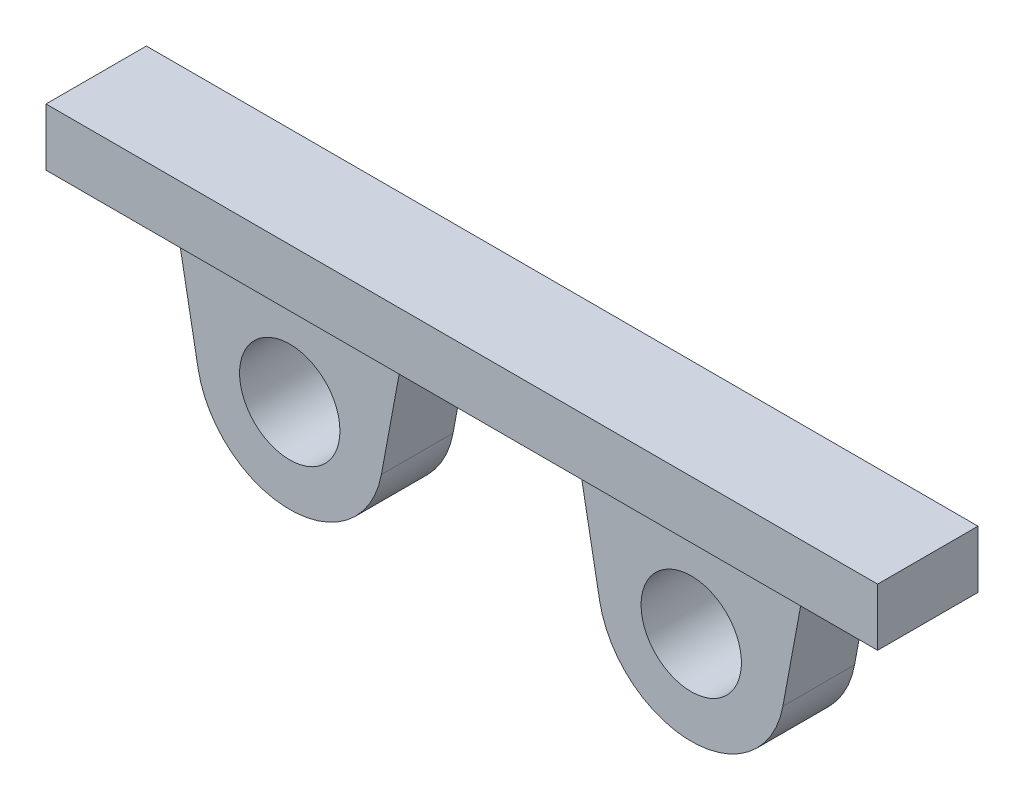
ISO-10303-21;
HEADER;
FILE_DESCRIPTION(('STEP AP214'),'2;1');
FILE_NAME('part.step','',(''),(''),'','','');
FILE_SCHEMA(('AUTOMOTIVE_DESIGN { 1 0 10303 214 1 1 1 1 }'));
ENDSEC;
DATA;
#1=APPLICATION_CONTEXT('core data for automotive mechanical design processes');
#2=APPLICATION_PROTOCOL_DEFINITION('international standard','automotive_design',2000,#1);
#3=PRODUCT_CONTEXT('',#1,'mechanical');
#4=PRODUCT('Part','Part','',(#3));
#5=PRODUCT_RELATED_PRODUCT_CATEGORY('part','',(#4));
#6=PRODUCT_DEFINITION_FORMATION('','',#4);
#7=PRODUCT_DEFINITION_CONTEXT('part definition',#1,'design');
#8=PRODUCT_DEFINITION('design','',#6,#7);
#9=PRODUCT_DEFINITION_SHAPE('','',#8);
#10=(LENGTH_UNIT() NAMED_UNIT(*) SI_UNIT(.MILLI.,.METRE.));
#11=(NAMED_UNIT(*) PLANE_ANGLE_UNIT() SI_UNIT($,.RADIAN.));
#12=(NAMED_UNIT(*) SI_UNIT($,.STERADIAN.) SOLID_ANGLE_UNIT());
#13=UNCERTAINTY_MEASURE_WITH_UNIT(LENGTH_MEASURE(1.E-05),#10,'distance_accuracy_value','');
#14=(GEOMETRIC_REPRESENTATION_CONTEXT(3) GLOBAL_UNCERTAINTY_ASSIGNED_CONTEXT((#13)) GLOBAL_UNIT_ASSIGNED_CONTEXT((#10,
#11,#12)) REPRESENTATION_CONTEXT('',''));
#15=CARTESIAN_POINT('',(0.,0.,0.));
#16=DIRECTION('',(0.,0.,1.));
#17=DIRECTION('',(1.,0.,0.));
#18=AXIS2_PLACEMENT_3D('',#15,#16,#17);
#19=CARTESIAN_POINT('',(-14.,0.,5.));
#20=DIRECTION('',(0.,0.,1.));
#21=DIRECTION('',(1.,0.,0.));
#22=AXIS2_PLACEMENT_3D('',#19,#20,#21);
#23=PLANE('',#22);
#24=DIRECTION('',(1.,0.,0.));
#25=VECTOR('',#24,1.);
#26=CARTESIAN_POINT('',(29.,7.5,5.));
#27=LINE('',#26,#25);
#28=CARTESIAN_POINT('',(-22.,7.5,5.));
#29=VERTEX_POINT('',#28);
#30=CARTESIAN_POINT('',(-6.,7.5,5.));
#31=VERTEX_POINT('',#30);
#32=EDGE_CURVE('E11',#29,#31,#27,.T.);
#33=ORIENTED_EDGE('',*,*,#32,.F.);
#34=DIRECTION('',(0.182154569069628,-0.983269908502776,0.));
#35=VECTOR('',#34,1.);
#36=CARTESIAN_POINT('',(-22.,7.5,5.));
#37=LINE('',#36,#35);
#38=CARTESIAN_POINT('',(-20.391254405268,-1.18400469895258,5.));
#39=VERTEX_POINT('',#38);
#40=EDGE_CURVE('E54',#29,#39,#37,.T.);
#41=ORIENTED_EDGE('',*,*,#40,.T.);
#42=CARTESIAN_POINT('',(-14.,0.,5.));
#43=DIRECTION('',(0.,0.,1.));
#44=DIRECTION('',(1.,0.,0.));
#45=AXIS2_PLACEMENT_3D('',#42,#43,#44);
#46=CIRCLE('',#45,6.5);
#47=CARTESIAN_POINT('',(-7.60874559473196,-1.18400469895258,5.));
#48=VERTEX_POINT('',#47);
#49=EDGE_CURVE('E178',#39,#48,#46,.T.);
#50=ORIENTED_EDGE('',*,*,#49,.T.);
#51=DIRECTION('',(0.182154569069628,0.983269908502776,0.));
#52=VECTOR('',#51,1.);
#53=CARTESIAN_POINT('',(-7.60874559473196,-1.18400469895258,5.));
#54=LINE('',#53,#52);
#55=EDGE_CURVE('E111',#48,#31,#54,.T.);
#56=ORIENTED_EDGE('',*,*,#55,.T.);
#57=EDGE_LOOP('',(#33,#41,#50,#56));
#58=FACE_BOUND('',#57,.T.);
#59=CARTESIAN_POINT('',(-14.,0.,5.));
#60=DIRECTION('',(0.,0.,1.));
#61=DIRECTION('',(1.,0.,0.));
#62=AXIS2_PLACEMENT_3D('',#59,#60,#61);
#63=CIRCLE('',#62,3.5);
#64=CARTESIAN_POINT('',(-10.5,0.,5.));
#65=VERTEX_POINT('',#64);
#66=EDGE_CURVE('E172',#65,#65,#63,.T.);
#67=ORIENTED_EDGE('',*,*,#66,.F.);
#68=EDGE_LOOP('',(#67));
#69=FACE_BOUND('',#68,.T.);
#70=ADVANCED_FACE('F35',(#58,#69),#23,.T.);
#71=CARTESIAN_POINT('',(6.,7.5,5.));
#72=VERTEX_POINT('',#71);
#73=CARTESIAN_POINT('',(22.,7.5,5.));
#74=VERTEX_POINT('',#73);
#75=EDGE_CURVE('E45',#72,#74,#27,.T.);
#76=ORIENTED_EDGE('',*,*,#75,.F.);
#77=DIRECTION('',(0.182154569069628,-0.983269908502776,0.));
#78=VECTOR('',#77,1.);
#79=CARTESIAN_POINT('',(7.60874559473196,-1.18400469895258,5.));
#80=LINE('',#79,#78);
#81=CARTESIAN_POINT('',(7.60874559473196,-1.18400469895258,5.));
#82=VERTEX_POINT('',#81);
#83=EDGE_CURVE('E181',#72,#82,#80,.T.);
#84=ORIENTED_EDGE('',*,*,#83,.T.);
#85=CARTESIAN_POINT('',(14.,0.,5.));
#86=DIRECTION('',(0.,0.,1.));
#87=DIRECTION('',(-1.,0.,0.));
#88=AXIS2_PLACEMENT_3D('',#85,#86,#87);
#89=CIRCLE('',#88,6.5);
#90=CARTESIAN_POINT('',(20.391254405268,-1.18400469895258,5.));
#91=VERTEX_POINT('',#90);
#92=EDGE_CURVE('E134',#82,#91,#89,.T.);
#93=ORIENTED_EDGE('',*,*,#92,.T.);
#94=DIRECTION('',(0.182154569069628,0.983269908502776,0.));
#95=VECTOR('',#94,1.);
#96=CARTESIAN_POINT('',(22.,7.5,5.));
#97=LINE('',#96,#95);
#98=EDGE_CURVE('E127',#91,#74,#97,.T.);
#99=ORIENTED_EDGE('',*,*,#98,.T.);
#100=EDGE_LOOP('',(#76,#84,#93,#99));
#101=FACE_BOUND('',#100,.T.);
#102=CARTESIAN_POINT('',(14.,0.,5.));
#103=DIRECTION('',(0.,0.,1.));
#104=DIRECTION('',(-1.,0.,0.));
#105=AXIS2_PLACEMENT_3D('',#102,#103,#104);
#106=CIRCLE('',#105,3.5);
#107=CARTESIAN_POINT('',(10.5,0.,5.));
#108=VERTEX_POINT('',#107);
#109=EDGE_CURVE('E166',#108,#108,#106,.T.);
#110=ORIENTED_EDGE('',*,*,#109,.F.);
#111=EDGE_LOOP('',(#110));
#112=FACE_BOUND('',#111,.T.);
#113=ADVANCED_FACE('F129',(#101,#112),#23,.T.);
#114=CARTESIAN_POINT('',(-14.,0.,0.));
#115=DIRECTION('',(0.,0.,1.));
#116=DIRECTION('',(1.,0.,0.));
#117=AXIS2_PLACEMENT_3D('',#114,#115,#116);
#118=PLANE('',#117);
#119=CARTESIAN_POINT('',(-14.,0.,0.));
#120=DIRECTION('',(0.,0.,1.));
#121=DIRECTION('',(1.,0.,0.));
#122=AXIS2_PLACEMENT_3D('',#119,#120,#121);
#123=CIRCLE('',#122,6.5);
#124=CARTESIAN_POINT('',(-20.391254405268,-1.18400469895258,0.));
#125=VERTEX_POINT('',#124);
#126=CARTESIAN_POINT('',(-7.60874559473196,-1.18400469895258,0.));
#127=VERTEX_POINT('',#126);
#128=EDGE_CURVE('E175',#125,#127,#123,.T.);
#129=ORIENTED_EDGE('',*,*,#128,.F.);
#130=DIRECTION('',(0.182154569069628,-0.983269908502776,0.));
#131=VECTOR('',#130,1.);
#132=CARTESIAN_POINT('',(-22.,7.5,0.));
#133=LINE('',#132,#131);
#134=CARTESIAN_POINT('',(-22.,7.5,0.));
#135=VERTEX_POINT('',#134);
#136=EDGE_CURVE('E102',#135,#125,#133,.T.);
#137=ORIENTED_EDGE('',*,*,#136,.F.);
#138=DIRECTION('',(1.,0.,0.));
#139=VECTOR('',#138,1.);
#140=CARTESIAN_POINT('',(-29.,7.5,0.));
#141=LINE('',#140,#139);
#142=CARTESIAN_POINT('',(-29.,7.5,0.));
#143=VERTEX_POINT('',#142);
#144=EDGE_CURVE('E96',#143,#135,#141,.T.);
#145=ORIENTED_EDGE('',*,*,#144,.F.);
#146=DIRECTION('',(0.,-1.,0.));
#147=VECTOR('',#146,1.);
#148=CARTESIAN_POINT('',(-29.,11.5,0.));
#149=LINE('',#148,#147);
#150=CARTESIAN_POINT('',(-29.,11.5,0.));
#151=VERTEX_POINT('',#150);
#152=EDGE_CURVE('E203',#151,#143,#149,.T.);
#153=ORIENTED_EDGE('',*,*,#152,.F.);
#154=DIRECTION('',(-1.,0.,0.));
#155=VECTOR('',#154,1.);
#156=CARTESIAN_POINT('',(29.,11.5,0.));
#157=LINE('',#156,#155);
#158=CARTESIAN_POINT('',(29.,11.5,0.));
#159=VERTEX_POINT('',#158);
#160=EDGE_CURVE('E201',#159,#151,#157,.T.);
#161=ORIENTED_EDGE('',*,*,#160,.F.);
#162=DIRECTION('',(0.,1.,0.));
#163=VECTOR('',#162,1.);
#164=CARTESIAN_POINT('',(29.,11.5,0.));
#165=LINE('',#164,#163);
#166=CARTESIAN_POINT('',(29.,7.5,0.));
#167=VERTEX_POINT('',#166);
#168=EDGE_CURVE('E199',#167,#159,#165,.T.);
#169=ORIENTED_EDGE('',*,*,#168,.F.);
#170=DIRECTION('',(1.,0.,0.));
#171=VECTOR('',#170,1.);
#172=CARTESIAN_POINT('',(29.,7.5,0.));
#173=LINE('',#172,#171);
#174=CARTESIAN_POINT('',(22.,7.5,0.));
#175=VERTEX_POINT('',#174);
#176=EDGE_CURVE('E197',#175,#167,#173,.T.);
#177=ORIENTED_EDGE('',*,*,#176,.F.);
#178=DIRECTION('',(0.182154569069628,0.983269908502776,0.));
#179=VECTOR('',#178,1.);
#180=CARTESIAN_POINT('',(22.,7.5,0.));
#181=LINE('',#180,#179);
#182=CARTESIAN_POINT('',(20.391254405268,-1.18400469895258,0.));
#183=VERTEX_POINT('',#182);
#184=EDGE_CURVE('E143',#183,#175,#181,.T.);
#185=ORIENTED_EDGE('',*,*,#184,.F.);
#186=CARTESIAN_POINT('',(14.,0.,0.));
#187=DIRECTION('',(0.,0.,1.));
#188=DIRECTION('',(-1.,0.,0.));
#189=AXIS2_PLACEMENT_3D('',#186,#187,#188);
#190=CIRCLE('',#189,6.5);
#191=CARTESIAN_POINT('',(7.60874559473196,-1.18400469895258,0.));
#192=VERTEX_POINT('',#191);
#193=EDGE_CURVE('E194',#192,#183,#190,.T.);
#194=ORIENTED_EDGE('',*,*,#193,.F.);
#195=DIRECTION('',(0.182154569069628,-0.983269908502776,0.));
#196=VECTOR('',#195,1.);
#197=CARTESIAN_POINT('',(7.60874559473196,-1.18400469895258,0.));
#198=LINE('',#197,#196);
#199=CARTESIAN_POINT('',(6.,7.5,0.));
#200=VERTEX_POINT('',#199);
#201=EDGE_CURVE('E192',#200,#192,#198,.T.);
#202=ORIENTED_EDGE('',*,*,#201,.F.);
#203=DIRECTION('',(1.,0.,0.));
#204=VECTOR('',#203,1.);
#205=CARTESIAN_POINT('',(-6.,7.5,0.));
#206=LINE('',#205,#204);
#207=CARTESIAN_POINT('',(-6.,7.5,0.));
#208=VERTEX_POINT('',#207);
#209=EDGE_CURVE('E190',#208,#200,#206,.T.);
#210=ORIENTED_EDGE('',*,*,#209,.F.);
#211=DIRECTION('',(0.182154569069628,0.983269908502776,0.));
#212=VECTOR('',#211,1.);
#213=CARTESIAN_POINT('',(-7.60874559473196,-1.18400469895258,0.));
#214=LINE('',#213,#212);
#215=EDGE_CURVE('E188',#127,#208,#214,.T.);
#216=ORIENTED_EDGE('',*,*,#215,.F.);
#217=EDGE_LOOP('',(#129,#137,#145,#153,#161,#169,#177,#185,#194,#202,#210,#216));
#218=FACE_BOUND('',#217,.T.);
#219=CARTESIAN_POINT('',(-14.,0.,0.));
#220=DIRECTION('',(0.,0.,1.));
#221=DIRECTION('',(1.,0.,0.));
#222=AXIS2_PLACEMENT_3D('',#219,#220,#221);
#223=CIRCLE('',#222,3.5);
#224=CARTESIAN_POINT('',(-10.5,0.,0.));
#225=VERTEX_POINT('',#224);
#226=EDGE_CURVE('E169',#225,#225,#223,.T.);
#227=ORIENTED_EDGE('',*,*,#226,.T.);
#228=EDGE_LOOP('',(#227));
#229=FACE_BOUND('',#228,.T.);
#230=CARTESIAN_POINT('',(14.,0.,0.));
#231=DIRECTION('',(0.,0.,1.));
#232=DIRECTION('',(-1.,0.,0.));
#233=AXIS2_PLACEMENT_3D('',#230,#231,#232);
#234=CIRCLE('',#233,3.5);
#235=CARTESIAN_POINT('',(10.5,0.,0.));
#236=VERTEX_POINT('',#235);
#237=EDGE_CURVE('E165',#236,#236,#234,.T.);
#238=ORIENTED_EDGE('',*,*,#237,.T.);
#239=EDGE_LOOP('',(#238));
#240=FACE_BOUND('',#239,.T.);
#241=ADVANCED_FACE('F229',(#218,#229,#240),#118,.F.);
#242=CARTESIAN_POINT('',(-14.,0.,5.));
#243=DIRECTION('',(0.,0.,-1.));
#244=DIRECTION('',(-1.,0.,0.));
#245=AXIS2_PLACEMENT_3D('',#242,#243,#244);
#246=CYLINDRICAL_SURFACE('',#245,6.5);
#247=ORIENTED_EDGE('',*,*,#128,.T.);
#248=DIRECTION('',(0.,0.,-1.));
#249=VECTOR('',#248,1.);
#250=CARTESIAN_POINT('',(-7.60874559473196,-1.18400469895258,5.));
#251=LINE('',#250,#249);
#252=EDGE_CURVE('E39',#48,#127,#251,.T.);
#253=ORIENTED_EDGE('',*,*,#252,.F.);
#254=ORIENTED_EDGE('',*,*,#49,.F.);
#255=DIRECTION('',(0.,0.,-1.));
#256=VECTOR('',#255,1.);
#257=CARTESIAN_POINT('',(-20.391254405268,-1.18400469895258,5.));
#258=LINE('',#257,#256);
#259=EDGE_CURVE('E185',#39,#125,#258,.T.);
#260=ORIENTED_EDGE('',*,*,#259,.T.);
#261=EDGE_LOOP('',(#247,#253,#254,#260));
#262=FACE_BOUND('',#261,.T.);
#263=ADVANCED_FACE('F37',(#262),#246,.T.);
#264=CARTESIAN_POINT('',(-7.60874559473196,-1.18400469895258,5.));
#265=DIRECTION('',(-0.983269908502776,0.182154569069628,0.));
#266=DIRECTION('',(-0.182154569069628,-0.983269908502777,0.));
#267=AXIS2_PLACEMENT_3D('',#264,#265,#266);
#268=PLANE('',#267);
#269=ORIENTED_EDGE('',*,*,#215,.T.);
#270=DIRECTION('',(0.,0.,-1.));
#271=VECTOR('',#270,1.);
#272=CARTESIAN_POINT('',(-6.,7.5,5.));
#273=LINE('',#272,#271);
#274=EDGE_CURVE('E152',#31,#208,#273,.T.);
#275=ORIENTED_EDGE('',*,*,#274,.F.);
#276=ORIENTED_EDGE('',*,*,#55,.F.);
#277=ORIENTED_EDGE('',*,*,#252,.T.);
#278=EDGE_LOOP('',(#269,#275,#276,#277));
#279=FACE_BOUND('',#278,.T.);
#280=ADVANCED_FACE('F359',(#279),#268,.F.);
#281=CARTESIAN_POINT('',(7.60874559473196,-1.18400469895258,5.));
#282=DIRECTION('',(0.983269908502776,0.182154569069628,0.));
#283=DIRECTION('',(-0.182154569069628,0.983269908502777,0.));
#284=AXIS2_PLACEMENT_3D('',#281,#282,#283);
#285=PLANE('',#284);
#286=ORIENTED_EDGE('',*,*,#201,.T.);
#287=DIRECTION('',(0.,0.,-1.));
#288=VECTOR('',#287,1.);
#289=CARTESIAN_POINT('',(7.60874559473196,-1.18400469895258,5.));
#290=LINE('',#289,#288);
#291=EDGE_CURVE('E221',#82,#192,#290,.T.);
#292=ORIENTED_EDGE('',*,*,#291,.F.);
#293=ORIENTED_EDGE('',*,*,#83,.F.);
#294=DIRECTION('',(0.,0.,-1.));
#295=VECTOR('',#294,1.);
#296=CARTESIAN_POINT('',(6.,7.5,5.));
#297=LINE('',#296,#295);
#298=EDGE_CURVE('E150',#72,#200,#297,.T.);
#299=ORIENTED_EDGE('',*,*,#298,.T.);
#300=EDGE_LOOP('',(#286,#292,#293,#299));
#301=FACE_BOUND('',#300,.T.);
#302=ADVANCED_FACE('F234',(#301),#285,.F.);
#303=CARTESIAN_POINT('',(14.,0.,5.));
#304=DIRECTION('',(0.,0.,-1.));
#305=DIRECTION('',(-1.,0.,0.));
#306=AXIS2_PLACEMENT_3D('',#303,#304,#305);
#307=CYLINDRICAL_SURFACE('',#306,6.5);
#308=ORIENTED_EDGE('',*,*,#193,.T.);
#309=DIRECTION('',(0.,0.,-1.));
#310=VECTOR('',#309,1.);
#311=CARTESIAN_POINT('',(20.391254405268,-1.18400469895258,5.));
#312=LINE('',#311,#310);
#313=EDGE_CURVE('E145',#91,#183,#312,.T.);
#314=ORIENTED_EDGE('',*,*,#313,.F.);
#315=ORIENTED_EDGE('',*,*,#92,.F.);
#316=ORIENTED_EDGE('',*,*,#291,.T.);
#317=EDGE_LOOP('',(#308,#314,#315,#316));
#318=FACE_BOUND('',#317,.T.);
#319=ADVANCED_FACE('F236',(#318),#307,.T.);
#320=CARTESIAN_POINT('',(22.,7.5,5.));
#321=DIRECTION('',(-0.983269908502776,0.182154569069628,0.));
#322=DIRECTION('',(-0.182154569069628,-0.983269908502777,0.));
#323=AXIS2_PLACEMENT_3D('',#320,#321,#322);
#324=PLANE('',#323);
#325=ORIENTED_EDGE('',*,*,#184,.T.);
#326=DIRECTION('',(0.,0.,-1.));
#327=VECTOR('',#326,1.);
#328=CARTESIAN_POINT('',(22.,7.5,5.));
#329=LINE('',#328,#327);
#330=EDGE_CURVE('E140',#74,#175,#329,.T.);
#331=ORIENTED_EDGE('',*,*,#330,.F.);
#332=ORIENTED_EDGE('',*,*,#98,.F.);
#333=ORIENTED_EDGE('',*,*,#313,.T.);
#334=EDGE_LOOP('',(#325,#331,#332,#333));
#335=FACE_BOUND('',#334,.T.);
#336=ADVANCED_FACE('F141',(#335),#324,.F.);
#337=CARTESIAN_POINT('',(29.,11.5,5.));
#338=DIRECTION('',(-1.,0.,0.));
#339=DIRECTION('',(0.,0.,1.));
#340=AXIS2_PLACEMENT_3D('',#337,#338,#339);
#341=PLANE('',#340);
#342=ORIENTED_EDGE('',*,*,#168,.T.);
#343=DIRECTION('',(0.,0.,-1.));
#344=VECTOR('',#343,1.);
#345=CARTESIAN_POINT('',(29.,11.5,5.));
#346=LINE('',#345,#344);
#347=CARTESIAN_POINT('',(29.,11.5,7.));
#348=VERTEX_POINT('',#347);
#349=EDGE_CURVE('E215',#348,#159,#346,.T.);
#350=ORIENTED_EDGE('',*,*,#349,.F.);
#351=DIRECTION('',(0.,-1.,0.));
#352=VECTOR('',#351,1.);
#353=CARTESIAN_POINT('',(29.,69.5344725141876,7.));
#354=LINE('',#353,#352);
#355=CARTESIAN_POINT('',(29.,7.5,7.));
#356=VERTEX_POINT('',#355);
#357=EDGE_CURVE('E160',#348,#356,#354,.T.);
#358=ORIENTED_EDGE('',*,*,#357,.T.);
#359=DIRECTION('',(0.,0.,-1.));
#360=VECTOR('',#359,1.);
#361=CARTESIAN_POINT('',(29.,7.5,5.));
#362=LINE('',#361,#360);
#363=EDGE_CURVE('E146',#356,#167,#362,.T.);
#364=ORIENTED_EDGE('',*,*,#363,.T.);
#365=EDGE_LOOP('',(#342,#350,#358,#364));
#366=FACE_BOUND('',#365,.T.);
#367=ADVANCED_FACE('F243',(#366),#341,.F.);
#368=CARTESIAN_POINT('',(29.,11.5,5.));
#369=DIRECTION('',(0.,-1.,0.));
#370=DIRECTION('',(0.,0.,-1.));
#371=AXIS2_PLACEMENT_3D('',#368,#369,#370);
#372=PLANE('',#371);
#373=ORIENTED_EDGE('',*,*,#160,.T.);
#374=DIRECTION('',(0.,0.,-1.));
#375=VECTOR('',#374,1.);
#376=CARTESIAN_POINT('',(-29.,11.5,5.));
#377=LINE('',#376,#375);
#378=CARTESIAN_POINT('',(-29.,11.5,6.99999999999999));
#379=VERTEX_POINT('',#378);
#380=EDGE_CURVE('E212',#379,#151,#377,.T.);
#381=ORIENTED_EDGE('',*,*,#380,.F.);
#382=DIRECTION('',(1.,0.,0.));
#383=VECTOR('',#382,1.);
#384=CARTESIAN_POINT('',(29.,11.5,7.));
#385=LINE('',#384,#383);
#386=EDGE_CURVE('E159',#379,#348,#385,.T.);
#387=ORIENTED_EDGE('',*,*,#386,.T.);
#388=ORIENTED_EDGE('',*,*,#349,.T.);
#389=EDGE_LOOP('',(#373,#381,#387,#388));
#390=FACE_BOUND('',#389,.T.);
#391=ADVANCED_FACE('F259',(#390),#372,.F.);
#392=CARTESIAN_POINT('',(-29.,11.5,5.));
#393=DIRECTION('',(1.,0.,0.));
#394=DIRECTION('',(0.,0.,-1.));
#395=AXIS2_PLACEMENT_3D('',#392,#393,#394);
#396=PLANE('',#395);
#397=ORIENTED_EDGE('',*,*,#152,.T.);
#398=DIRECTION('',(0.,0.,-1.));
#399=VECTOR('',#398,1.);
#400=CARTESIAN_POINT('',(-29.,7.5,5.));
#401=LINE('',#400,#399);
#402=CARTESIAN_POINT('',(-29.,7.5,6.99999999999999));
#403=VERTEX_POINT('',#402);
#404=EDGE_CURVE('E210',#403,#143,#401,.T.);
#405=ORIENTED_EDGE('',*,*,#404,.F.);
#406=DIRECTION('',(0.,-1.,0.));
#407=VECTOR('',#406,1.);
#408=CARTESIAN_POINT('',(-29.,69.5344725141876,6.99999999999999));
#409=LINE('',#408,#407);
#410=EDGE_CURVE('E156',#379,#403,#409,.T.);
#411=ORIENTED_EDGE('',*,*,#410,.F.);
#412=ORIENTED_EDGE('',*,*,#380,.T.);
#413=EDGE_LOOP('',(#397,#405,#411,#412));
#414=FACE_BOUND('',#413,.T.);
#415=ADVANCED_FACE('F261',(#414),#396,.F.);
#416=CARTESIAN_POINT('',(-29.,7.5,5.));
#417=DIRECTION('',(0.,1.,0.));
#418=DIRECTION('',(-1.,0.,0.));
#419=AXIS2_PLACEMENT_3D('',#416,#417,#418);
#420=PLANE('',#419);
#421=ORIENTED_EDGE('',*,*,#144,.T.);
#422=DIRECTION('',(0.,0.,-1.));
#423=VECTOR('',#422,1.);
#424=CARTESIAN_POINT('',(-22.,7.5,5.));
#425=LINE('',#424,#423);
#426=EDGE_CURVE('E208',#29,#135,#425,.T.);
#427=ORIENTED_EDGE('',*,*,#426,.F.);
#428=ORIENTED_EDGE('',*,*,#32,.T.);
#429=ORIENTED_EDGE('',*,*,#274,.T.);
#430=ORIENTED_EDGE('',*,*,#209,.T.);
#431=ORIENTED_EDGE('',*,*,#298,.F.);
#432=ORIENTED_EDGE('',*,*,#75,.T.);
#433=ORIENTED_EDGE('',*,*,#330,.T.);
#434=ORIENTED_EDGE('',*,*,#176,.T.);
#435=ORIENTED_EDGE('',*,*,#363,.F.);
#436=DIRECTION('',(-1.,0.,0.));
#437=VECTOR('',#436,1.);
#438=CARTESIAN_POINT('',(29.,7.5,7.));
#439=LINE('',#438,#437);
#440=EDGE_CURVE('E155',#356,#403,#439,.T.);
#441=ORIENTED_EDGE('',*,*,#440,.T.);
#442=ORIENTED_EDGE('',*,*,#404,.T.);
#443=EDGE_LOOP('',(#421,#427,#428,#429,#430,#431,#432,#433,#434,#435,#441,#442));
#444=FACE_BOUND('',#443,.T.);
#445=ADVANCED_FACE('F148',(#444),#420,.F.);
#446=CARTESIAN_POINT('',(-22.,7.5,5.));
#447=DIRECTION('',(0.983269908502776,0.182154569069628,0.));
#448=DIRECTION('',(-0.182154569069628,0.983269908502777,0.));
#449=AXIS2_PLACEMENT_3D('',#446,#447,#448);
#450=PLANE('',#449);
#451=ORIENTED_EDGE('',*,*,#136,.T.);
#452=ORIENTED_EDGE('',*,*,#259,.F.);
#453=ORIENTED_EDGE('',*,*,#40,.F.);
#454=ORIENTED_EDGE('',*,*,#426,.T.);
#455=EDGE_LOOP('',(#451,#452,#453,#454));
#456=FACE_BOUND('',#455,.T.);
#457=ADVANCED_FACE('F268',(#456),#450,.F.);
#458=CARTESIAN_POINT('',(-14.,0.,5.));
#459=DIRECTION('',(0.,0.,-1.));
#460=DIRECTION('',(-1.,0.,0.));
#461=AXIS2_PLACEMENT_3D('',#458,#459,#460);
#462=CYLINDRICAL_SURFACE('',#461,3.5);
#463=ORIENTED_EDGE('',*,*,#66,.T.);
#464=EDGE_LOOP('',(#463));
#465=FACE_BOUND('',#464,.T.);
#466=ORIENTED_EDGE('',*,*,#226,.F.);
#467=EDGE_LOOP('',(#466));
#468=FACE_BOUND('',#467,.T.);
#469=ADVANCED_FACE('F279',(#465,#468),#462,.F.);
#470=CARTESIAN_POINT('',(14.,0.,5.));
#471=DIRECTION('',(0.,0.,-1.));
#472=DIRECTION('',(-1.,0.,0.));
#473=AXIS2_PLACEMENT_3D('',#470,#471,#472);
#474=CYLINDRICAL_SURFACE('',#473,3.5);
#475=ORIENTED_EDGE('',*,*,#109,.T.);
#476=EDGE_LOOP('',(#475));
#477=FACE_BOUND('',#476,.T.);
#478=ORIENTED_EDGE('',*,*,#237,.F.);
#479=EDGE_LOOP('',(#478));
#480=FACE_BOUND('',#479,.T.);
#481=ADVANCED_FACE('F287',(#477,#480),#474,.F.);
#482=CARTESIAN_POINT('',(29.,69.5344725141876,7.));
#483=DIRECTION('',(0.,0.,1.));
#484=DIRECTION('',(1.,0.,0.));
#485=AXIS2_PLACEMENT_3D('',#482,#483,#484);
#486=PLANE('',#485);
#487=ORIENTED_EDGE('',*,*,#386,.F.);
#488=ORIENTED_EDGE('',*,*,#410,.T.);
#489=ORIENTED_EDGE('',*,*,#440,.F.);
#490=ORIENTED_EDGE('',*,*,#357,.F.);
#491=EDGE_LOOP('',(#487,#488,#489,#490));
#492=FACE_BOUND('',#491,.T.);
#493=ADVANCED_FACE('F251',(#492),#486,.T.);
#494=CLOSED_SHELL('',(#70,#113,#241,#263,#280,#302,#319,#336,#367,#391,#415,#445,#457,#469,#481,#493));
#495=MANIFOLD_SOLID_BREP('B2',#494);
#496=ADVANCED_BREP_SHAPE_REPRESENTATION('',(#18,#495),#14);
#497=SHAPE_DEFINITION_REPRESENTATION(#9,#496);
ENDSEC;
END-ISO-10303-21;
